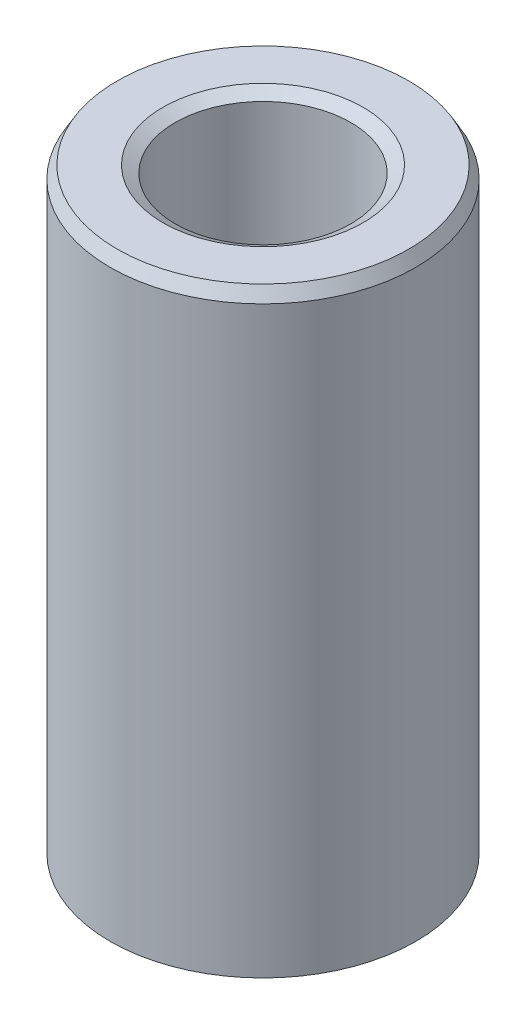
ISO-10303-21;
HEADER;
FILE_DESCRIPTION(('STEP AP214'),'2;1');
FILE_NAME('part.step','',(''),(''),'','','');
FILE_SCHEMA(('AUTOMOTIVE_DESIGN { 1 0 10303 214 1 1 1 1 }'));
ENDSEC;
DATA;
#1=APPLICATION_CONTEXT('core data for automotive mechanical design processes');
#2=APPLICATION_PROTOCOL_DEFINITION('international standard','automotive_design',2000,#1);
#3=PRODUCT_CONTEXT('',#1,'mechanical');
#4=PRODUCT('Part','Part','',(#3));
#5=PRODUCT_RELATED_PRODUCT_CATEGORY('part','',(#4));
#6=PRODUCT_DEFINITION_FORMATION('','',#4);
#7=PRODUCT_DEFINITION_CONTEXT('part definition',#1,'design');
#8=PRODUCT_DEFINITION('design','',#6,#7);
#9=PRODUCT_DEFINITION_SHAPE('','',#8);
#10=(LENGTH_UNIT() NAMED_UNIT(*) SI_UNIT(.MILLI.,.METRE.));
#11=(NAMED_UNIT(*) PLANE_ANGLE_UNIT() SI_UNIT($,.RADIAN.));
#12=(NAMED_UNIT(*) SI_UNIT($,.STERADIAN.) SOLID_ANGLE_UNIT());
#13=UNCERTAINTY_MEASURE_WITH_UNIT(LENGTH_MEASURE(1.E-05),#10,'distance_accuracy_value','');
#14=(GEOMETRIC_REPRESENTATION_CONTEXT(3) GLOBAL_UNCERTAINTY_ASSIGNED_CONTEXT((#13)) GLOBAL_UNIT_ASSIGNED_CONTEXT((#10,
#11,#12)) REPRESENTATION_CONTEXT('',''));
#15=CARTESIAN_POINT('',(0.,0.,0.));
#16=DIRECTION('',(0.,0.,1.));
#17=DIRECTION('',(1.,0.,0.));
#18=AXIS2_PLACEMENT_3D('',#15,#16,#17);
#19=CARTESIAN_POINT('',(0.,138.092901056444,0.));
#20=DIRECTION('',(0.,-1.,0.));
#21=DIRECTION('',(0.,0.,-1.));
#22=AXIS2_PLACEMENT_3D('',#19,#20,#21);
#23=CYLINDRICAL_SURFACE('',#22,35.);
#24=CARTESIAN_POINT('',(0.,1.61965639797385,0.));
#25=DIRECTION('',(0.,1.,0.));
#26=DIRECTION('',(0.,0.,1.));
#27=AXIS2_PLACEMENT_3D('',#24,#25,#26);
#28=CIRCLE('',#27,35.);
#29=CARTESIAN_POINT('',(0.,1.61965639797385,35.));
#30=VERTEX_POINT('',#29);
#31=EDGE_CURVE('E10',#30,#30,#28,.T.);
#32=ORIENTED_EDGE('',*,*,#31,.T.);
#33=EDGE_LOOP('',(#32));
#34=FACE_BOUND('',#33,.T.);
#35=CARTESIAN_POINT('',(0.,135.28757388435,0.));
#36=DIRECTION('',(0.,1.,0.));
#37=DIRECTION('',(0.,0.,1.));
#38=AXIS2_PLACEMENT_3D('',#35,#36,#37);
#39=CIRCLE('',#38,35.);
#40=CARTESIAN_POINT('',(0.,135.28757388435,35.));
#41=VERTEX_POINT('',#40);
#42=EDGE_CURVE('E50',#41,#41,#39,.F.);
#43=ORIENTED_EDGE('',*,*,#42,.T.);
#44=EDGE_LOOP('',(#43));
#45=FACE_BOUND('',#44,.T.);
#46=ADVANCED_FACE('F39',(#34,#45),#23,.T.);
#47=CARTESIAN_POINT('',(0.,138.092901056444,0.));
#48=DIRECTION('',(0.,1.,0.));
#49=DIRECTION('',(0.,0.,1.));
#50=AXIS2_PLACEMENT_3D('',#47,#48,#49);
#51=PLANE('',#50);
#52=CARTESIAN_POINT('',(0.,138.092901056444,0.));
#53=DIRECTION('',(0.,1.,0.));
#54=DIRECTION('',(0.,0.,1.));
#55=AXIS2_PLACEMENT_3D('',#52,#53,#54);
#56=CIRCLE('',#55,22.9193734894898);
#57=CARTESIAN_POINT('',(0.,138.092901056444,22.9193734894898));
#58=VERTEX_POINT('',#57);
#59=EDGE_CURVE('E58',#58,#58,#56,.F.);
#60=ORIENTED_EDGE('',*,*,#59,.T.);
#61=EDGE_LOOP('',(#60));
#62=FACE_BOUND('',#61,.T.);
#63=CARTESIAN_POINT('',(0.,138.092901056444,0.));
#64=DIRECTION('',(0.,1.,0.));
#65=DIRECTION('',(0.,0.,1.));
#66=AXIS2_PLACEMENT_3D('',#63,#64,#65);
#67=CIRCLE('',#66,33.3803436020262);
#68=CARTESIAN_POINT('',(0.,138.092901056444,33.3803436020262));
#69=VERTEX_POINT('',#68);
#70=EDGE_CURVE('E61',#69,#69,#67,.T.);
#71=ORIENTED_EDGE('',*,*,#70,.T.);
#72=EDGE_LOOP('',(#71));
#73=FACE_BOUND('',#72,.T.);
#74=ADVANCED_FACE('F88',(#62,#73),#51,.T.);
#75=CARTESIAN_POINT('',(0.,0.,0.));
#76=DIRECTION('',(0.,1.,0.));
#77=DIRECTION('',(0.,0.,1.));
#78=AXIS2_PLACEMENT_3D('',#75,#76,#77);
#79=PLANE('',#78);
#80=CARTESIAN_POINT('',(0.,0.,0.));
#81=DIRECTION('',(0.,1.,0.));
#82=DIRECTION('',(0.,0.,1.));
#83=AXIS2_PLACEMENT_3D('',#80,#81,#82);
#84=CIRCLE('',#83,21.733702715369);
#85=CARTESIAN_POINT('',(0.,0.,21.733702715369));
#86=VERTEX_POINT('',#85);
#87=EDGE_CURVE('E51',#86,#86,#84,.T.);
#88=ORIENTED_EDGE('',*,*,#87,.T.);
#89=EDGE_LOOP('',(#88));
#90=FACE_BOUND('',#89,.T.);
#91=CARTESIAN_POINT('',(0.,0.,0.));
#92=DIRECTION('',(0.,1.,0.));
#93=DIRECTION('',(0.,0.,1.));
#94=AXIS2_PLACEMENT_3D('',#91,#92,#93);
#95=CIRCLE('',#94,32.1946728279053);
#96=CARTESIAN_POINT('',(0.,0.,32.1946728279053));
#97=VERTEX_POINT('',#96);
#98=EDGE_CURVE('E54',#97,#97,#95,.F.);
#99=ORIENTED_EDGE('',*,*,#98,.T.);
#100=EDGE_LOOP('',(#99));
#101=FACE_BOUND('',#100,.T.);
#102=ADVANCED_FACE('F83',(#90,#101),#79,.F.);
#103=CARTESIAN_POINT('',(0.,138.092901056444,0.));
#104=DIRECTION('',(0.,-1.,0.));
#105=DIRECTION('',(0.,0.,-1.));
#106=AXIS2_PLACEMENT_3D('',#103,#104,#105);
#107=CYLINDRICAL_SURFACE('',#106,20.1140463173952);
#108=CARTESIAN_POINT('',(0.,136.47324465847,0.));
#109=DIRECTION('',(0.,1.,0.));
#110=DIRECTION('',(0.,0.,1.));
#111=AXIS2_PLACEMENT_3D('',#108,#109,#110);
#112=CIRCLE('',#111,20.1140463173952);
#113=CARTESIAN_POINT('',(0.,136.47324465847,20.1140463173952));
#114=VERTEX_POINT('',#113);
#115=EDGE_CURVE('E67',#114,#114,#112,.T.);
#116=ORIENTED_EDGE('',*,*,#115,.T.);
#117=EDGE_LOOP('',(#116));
#118=FACE_BOUND('',#117,.T.);
#119=CARTESIAN_POINT('',(0.,2.80532717209472,0.));
#120=DIRECTION('',(0.,1.,0.));
#121=DIRECTION('',(0.,0.,1.));
#122=AXIS2_PLACEMENT_3D('',#119,#120,#121);
#123=CIRCLE('',#122,20.1140463173952);
#124=CARTESIAN_POINT('',(0.,2.80532717209472,20.1140463173952));
#125=VERTEX_POINT('',#124);
#126=EDGE_CURVE('E69',#125,#125,#123,.F.);
#127=ORIENTED_EDGE('',*,*,#126,.T.);
#128=EDGE_LOOP('',(#127));
#129=FACE_BOUND('',#128,.T.);
#130=ADVANCED_FACE('F71',(#118,#129),#107,.F.);
#131=CARTESIAN_POINT('',(0.,136.47324465847,0.));
#132=DIRECTION('',(0.,1.,0.));
#133=DIRECTION('',(0.,0.,1.));
#134=AXIS2_PLACEMENT_3D('',#131,#132,#133);
#135=CONICAL_SURFACE('',#134,20.1140463173952,1.0471975511966);
#136=CARTESIAN_POINT('',(0.,138.092901056444,22.9193734894898));
#137=CARTESIAN_POINT('',(0.,138.076029635632,22.8901513314472));
#138=CARTESIAN_POINT('',(0.,138.05915821482,22.8609291734045));
#139=CARTESIAN_POINT('',(0.,138.025415373195,22.8024848573192));
#140=CARTESIAN_POINT('',(0.,138.008543952383,22.7732626992765));
#141=CARTESIAN_POINT('',(0.,137.974801110759,22.7148183831912));
#142=CARTESIAN_POINT('',(0.,137.957929689946,22.6855962251486));
#143=CARTESIAN_POINT('',(0.,137.924186848322,22.6271519090633));
#144=CARTESIAN_POINT('',(0.,137.90731542751,22.5979297510206));
#145=CARTESIAN_POINT('',(0.,137.873572585885,22.5394854349353));
#146=CARTESIAN_POINT('',(0.,137.856701165073,22.5102632768927));
#147=CARTESIAN_POINT('',(0.,137.822958323449,22.4518189608074));
#148=CARTESIAN_POINT('',(0.,137.806086902636,22.4225968027647));
#149=CARTESIAN_POINT('',(0.,137.772344061012,22.3641524866794));
#150=CARTESIAN_POINT('',(0.,137.7554726402,22.3349303286368));
#151=CARTESIAN_POINT('',(0.,137.721729798575,22.2764860125515));
#152=CARTESIAN_POINT('',(0.,137.704858377763,22.2472638545088));
#153=CARTESIAN_POINT('',(0.,137.671115536139,22.1888195384235));
#154=CARTESIAN_POINT('',(0.,137.654244115326,22.1595973803808));
#155=CARTESIAN_POINT('',(0.,137.620501273702,22.1011530642955));
#156=CARTESIAN_POINT('',(0.,137.60362985289,22.0719309062529));
#157=CARTESIAN_POINT('',(0.,137.569887011265,22.0134865901676));
#158=CARTESIAN_POINT('',(0.,137.553015590453,21.9842644321249));
#159=CARTESIAN_POINT('',(0.,137.519272748828,21.9258201160396));
#160=CARTESIAN_POINT('',(0.,137.502401328016,21.896597957997));
#161=CARTESIAN_POINT('',(0.,137.468658486392,21.8381536419117));
#162=CARTESIAN_POINT('',(0.,137.45178706558,21.808931483869));
#163=CARTESIAN_POINT('',(0.,137.418044223955,21.7504871677837));
#164=CARTESIAN_POINT('',(0.,137.401172803143,21.721265009741));
#165=CARTESIAN_POINT('',(0.,137.367429961518,21.6628206936557));
#166=CARTESIAN_POINT('',(0.,137.350558540706,21.6335985356131));
#167=CARTESIAN_POINT('',(0.,137.316815699082,21.5751542195278));
#168=CARTESIAN_POINT('',(0.,137.299944278269,21.5459320614851));
#169=CARTESIAN_POINT('',(0.,137.266201436645,21.4874877453998));
#170=CARTESIAN_POINT('',(0.,137.249330015833,21.4582655873572));
#171=CARTESIAN_POINT('',(0.,137.215587174208,21.3998212712719));
#172=CARTESIAN_POINT('',(0.,137.198715753396,21.3705991132292));
#173=CARTESIAN_POINT('',(0.,137.164972911772,21.3121547971439));
#174=CARTESIAN_POINT('',(0.,137.148101490959,21.2829326391013));
#175=CARTESIAN_POINT('',(0.,137.114358649335,21.224488323016));
#176=CARTESIAN_POINT('',(0.,137.097487228523,21.1952661649733));
#177=CARTESIAN_POINT('',(0.,137.063744386898,21.136821848888));
#178=CARTESIAN_POINT('',(0.,137.046872966086,21.1075996908453));
#179=CARTESIAN_POINT('',(0.,137.013130124462,21.04915537476));
#180=CARTESIAN_POINT('',(0.,136.996258703649,21.0199332167174));
#181=CARTESIAN_POINT('',(0.,136.962515862025,20.9614889006321));
#182=CARTESIAN_POINT('',(0.,136.945644441213,20.9322667425894));
#183=CARTESIAN_POINT('',(0.,136.911901599588,20.8738224265041));
#184=CARTESIAN_POINT('',(0.,136.895030178776,20.8446002684615));
#185=CARTESIAN_POINT('',(0.,136.861287337152,20.7861559523762));
#186=CARTESIAN_POINT('',(0.,136.844415916339,20.7569337943335));
#187=CARTESIAN_POINT('',(0.,136.810673074715,20.6984894782482));
#188=CARTESIAN_POINT('',(0.,136.793801653903,20.6692673202056));
#189=CARTESIAN_POINT('',(0.,136.760058812278,20.6108230041203));
#190=CARTESIAN_POINT('',(0.,136.743187391466,20.5816008460776));
#191=CARTESIAN_POINT('',(0.,136.709444549842,20.5231565299923));
#192=CARTESIAN_POINT('',(0.,136.692573129029,20.4939343719496));
#193=CARTESIAN_POINT('',(0.,136.658830287405,20.4354900558643));
#194=CARTESIAN_POINT('',(0.,136.641958866593,20.4062678978217));
#195=CARTESIAN_POINT('',(0.,136.608216024968,20.3478235817364));
#196=CARTESIAN_POINT('',(0.,136.591344604156,20.3186014236937));
#197=CARTESIAN_POINT('',(0.,136.557601762532,20.2601571076084));
#198=CARTESIAN_POINT('',(0.,136.540730341719,20.2309349495658));
#199=CARTESIAN_POINT('',(0.,136.506987500095,20.1724906334805));
#200=CARTESIAN_POINT('',(0.,136.490116079283,20.1432684754378));
#201=CARTESIAN_POINT('',(0.,136.47324465847,20.1140463173952));
#202=B_SPLINE_CURVE_WITH_KNOTS('',3,(#136,#137,#138,#139,#140,#141,#142,#143,#144,#145,#146,
#147,#148,#149,#150,#151,#152,#153,#154,#155,#156,#157,#158,#159,#160,#161,#162,#163,#164,#165,
#166,#167,#168,#169,#170,#171,#172,#173,#174,#175,#176,#177,#178,#179,#180,#181,#182,#183,#184,
#185,#186,#187,#188,#189,#190,#191,#192,#193,#194,#195,#196,#197,#198,#199,#200,#201),
.UNSPECIFIED.,.F.,.F.,(4,2,2,2,2,2,2,2,2,2,2,2,2,2,2,2,2,2,2,2,2,2,2,2,2,2,2,2,2,2,2,2,4),(0.,
0.101228524873365,0.202457049746733,0.303685574620098,0.404914099493466,0.506142624366816,
0.607371149240184,0.708599674113552,0.809828198986917,0.911056723860285,1.01228524873364,
1.113513773607,1.21474229848037,1.31597082335374,1.41719934822709,1.51842787310046,
1.61965639797382,1.72088492284719,1.82211344772056,1.92334197259391,2.02457049746728,
2.12579902234064,2.22702754721401,2.32825607208736,2.42948459696073,2.5307131218341,
2.63194164670746,2.73317017158083,2.83439869645418,2.93562722132755,3.03685574620091,
3.13808427107428,3.23931279594763),.UNSPECIFIED.);
#203=EDGE_CURVE('BSEAM77',#58,#114,#202,.T.);
#204=ORIENTED_EDGE('',*,*,#59,.F.);
#205=ORIENTED_EDGE('',*,*,#115,.F.);
#206=ORIENTED_EDGE('',*,*,#203,.T.);
#207=ORIENTED_EDGE('',*,*,#203,.F.);
#208=EDGE_LOOP('',(#204,#206,#205,#207));
#209=FACE_BOUND('',#208,.T.);
#210=ADVANCED_FACE('F77',(#209),#135,.F.);
#211=CARTESIAN_POINT('',(0.,0.,0.));
#212=DIRECTION('',(0.,-1.,0.));
#213=DIRECTION('',(0.,0.,-1.));
#214=AXIS2_PLACEMENT_3D('',#211,#212,#213);
#215=CONICAL_SURFACE('',#214,21.733702715369,0.523598775598297);
#216=ORIENTED_EDGE('',*,*,#126,.F.);
#217=EDGE_LOOP('',(#216));
#218=FACE_BOUND('',#217,.T.);
#219=ORIENTED_EDGE('',*,*,#87,.F.);
#220=EDGE_LOOP('',(#219));
#221=FACE_BOUND('',#220,.T.);
#222=ADVANCED_FACE('F73',(#218,#221),#215,.F.);
#223=CARTESIAN_POINT('',(0.,1.61965639797385,0.));
#224=DIRECTION('',(0.,1.,0.));
#225=DIRECTION('',(0.,0.,1.));
#226=AXIS2_PLACEMENT_3D('',#223,#224,#225);
#227=CONICAL_SURFACE('',#226,35.,1.0471975511966);
#228=CARTESIAN_POINT('',(0.,0.,32.1946728279053));
#229=CARTESIAN_POINT('',(0.,0.0168714208122273,32.2238949859479));
#230=CARTESIAN_POINT('',(0.,0.0337428416244549,32.2531171439906));
#231=CARTESIAN_POINT('',(0.,0.06748568324891,32.3115614600759));
#232=CARTESIAN_POINT('',(0.,0.0843571040611376,32.3407836181186));
#233=CARTESIAN_POINT('',(0.,0.118099945685593,32.3992279342039));
#234=CARTESIAN_POINT('',(0.,0.13497136649782,32.4284500922465));
#235=CARTESIAN_POINT('',(0.,0.168714208122275,32.4868944083318));
#236=CARTESIAN_POINT('',(0.,0.185585628934503,32.5161165663745));
#237=CARTESIAN_POINT('',(0.,0.219328470558958,32.5745608824598));
#238=CARTESIAN_POINT('',(0.,0.236199891371185,32.6037830405024));
#239=CARTESIAN_POINT('',(0.,0.269942732995641,32.6622273565877));
#240=CARTESIAN_POINT('',(0.,0.286814153807869,32.6914495146304));
#241=CARTESIAN_POINT('',(0.,0.320556995432324,32.7498938307157));
#242=CARTESIAN_POINT('',(0.,0.337428416244551,32.7791159887584));
#243=CARTESIAN_POINT('',(0.,0.371171257869005,32.8375603048437));
#244=CARTESIAN_POINT('',(0.,0.388042678681233,32.8667824628863));
#245=CARTESIAN_POINT('',(0.,0.421785520305689,32.9252267789716));
#246=CARTESIAN_POINT('',(0.,0.438656941117916,32.9544489370143));
#247=CARTESIAN_POINT('',(0.,0.472399782742371,33.0128932530996));
#248=CARTESIAN_POINT('',(0.,0.489271203554599,33.0421154111422));
#249=CARTESIAN_POINT('',(0.,0.523014045179054,33.1005597272275));
#250=CARTESIAN_POINT('',(0.,0.539885465991282,33.1297818852702));
#251=CARTESIAN_POINT('',(0.,0.573628307615737,33.1882262013555));
#252=CARTESIAN_POINT('',(0.,0.590499728427964,33.2174483593982));
#253=CARTESIAN_POINT('',(0.,0.624242570052419,33.2758926754835));
#254=CARTESIAN_POINT('',(0.,0.641113990864647,33.3051148335261));
#255=CARTESIAN_POINT('',(0.,0.674856832489102,33.3635591496114));
#256=CARTESIAN_POINT('',(0.,0.69172825330133,33.3927813076541));
#257=CARTESIAN_POINT('',(0.,0.725471094925785,33.4512256237394));
#258=CARTESIAN_POINT('',(0.,0.742342515738012,33.480447781782));
#259=CARTESIAN_POINT('',(0.,0.776085357362468,33.5388920978673));
#260=CARTESIAN_POINT('',(0.,0.792956778174696,33.56811425591));
#261=CARTESIAN_POINT('',(0.,0.82669961979915,33.6265585719953));
#262=CARTESIAN_POINT('',(0.,0.843571040611377,33.655780730038));
#263=CARTESIAN_POINT('',(0.,0.877313882235832,33.7142250461233));
#264=CARTESIAN_POINT('',(0.,0.89418530304806,33.7434472041659));
#265=CARTESIAN_POINT('',(0.,0.927928144672516,33.8018915202512));
#266=CARTESIAN_POINT('',(0.,0.944799565484743,33.8311136782939));
#267=CARTESIAN_POINT('',(0.,0.978542407109198,33.8895579943792));
#268=CARTESIAN_POINT('',(0.,0.995413827921426,33.9187801524218));
#269=CARTESIAN_POINT('',(0.,1.02915666954588,33.9772244685071));
#270=CARTESIAN_POINT('',(0.,1.04602809035811,34.0064466265498));
#271=CARTESIAN_POINT('',(0.,1.07977093198256,34.0648909426351));
#272=CARTESIAN_POINT('',(0.,1.09664235279479,34.0941131006778));
#273=CARTESIAN_POINT('',(0.,1.13038519441925,34.1525574167631));
#274=CARTESIAN_POINT('',(0.,1.14725661523147,34.1817795748057));
#275=CARTESIAN_POINT('',(0.,1.18099945685593,34.240223890891));
#276=CARTESIAN_POINT('',(0.,1.19787087766816,34.2694460489337));
#277=CARTESIAN_POINT('',(0.,1.23161371929261,34.327890365019));
#278=CARTESIAN_POINT('',(0.,1.24848514010484,34.3571125230616));
#279=CARTESIAN_POINT('',(0.,1.28222798172929,34.4155568391469));
#280=CARTESIAN_POINT('',(0.,1.29909940254152,34.4447789971896));
#281=CARTESIAN_POINT('',(0.,1.33284224416598,34.5032233132749));
#282=CARTESIAN_POINT('',(0.,1.3497136649782,34.5324454713176));
#283=CARTESIAN_POINT('',(0.,1.38345650660266,34.5908897874029));
#284=CARTESIAN_POINT('',(0.,1.40032792741489,34.6201119454455));
#285=CARTESIAN_POINT('',(0.,1.43407076903934,34.6785562615308));
#286=CARTESIAN_POINT('',(0.,1.45094218985157,34.7077784195735));
#287=CARTESIAN_POINT('',(0.,1.48468503147602,34.7662227356588));
#288=CARTESIAN_POINT('',(0.,1.50155645228825,34.7954448937014));
#289=CARTESIAN_POINT('',(0.,1.53529929391271,34.8538892097867));
#290=CARTESIAN_POINT('',(0.,1.55217071472493,34.8831113678294));
#291=CARTESIAN_POINT('',(0.,1.58591355634939,34.9415556839147));
#292=CARTESIAN_POINT('',(0.,1.60278497716162,34.9707778419574));
#293=CARTESIAN_POINT('',(0.,1.61965639797385,35.));
#294=B_SPLINE_CURVE_WITH_KNOTS('',3,(#228,#229,#230,#231,#232,#233,#234,#235,#236,#237,#238,
#239,#240,#241,#242,#243,#244,#245,#246,#247,#248,#249,#250,#251,#252,#253,#254,#255,#256,#257,
#258,#259,#260,#261,#262,#263,#264,#265,#266,#267,#268,#269,#270,#271,#272,#273,#274,#275,#276,
#277,#278,#279,#280,#281,#282,#283,#284,#285,#286,#287,#288,#289,#290,#291,#292,#293),
.UNSPECIFIED.,.F.,.F.,(4,2,2,2,2,2,2,2,2,2,2,2,2,2,2,2,2,2,2,2,2,2,2,2,2,2,2,2,2,2,2,2,4),(0.,
0.101228524873365,0.202457049746731,0.303685574620096,0.404914099493461,0.506142624366826,
0.607371149240192,0.708599674113563,0.809828198986928,0.911056723860294,1.01228524873366,
1.11351377360702,1.21474229848039,1.31597082335376,1.41719934822712,1.51842787310049,
1.61965639797385,1.72088492284722,1.82211344772059,1.92334197259395,2.02457049746732,
2.12579902234068,2.22702754721405,2.32825607208741,2.42948459696078,2.53071312183414,
2.63194164670751,2.73317017158088,2.83439869645425,2.93562722132761,3.03685574620098,
3.13808427107434,3.23931279594771),.UNSPECIFIED.);
#295=EDGE_CURVE('BSEAM76',#97,#30,#294,.T.);
#296=ORIENTED_EDGE('',*,*,#98,.F.);
#297=ORIENTED_EDGE('',*,*,#31,.F.);
#298=ORIENTED_EDGE('',*,*,#295,.T.);
#299=ORIENTED_EDGE('',*,*,#295,.F.);
#300=EDGE_LOOP('',(#296,#298,#297,#299));
#301=FACE_BOUND('',#300,.T.);
#302=ADVANCED_FACE('F76',(#301),#227,.T.);
#303=CARTESIAN_POINT('',(0.,138.092901056444,0.));
#304=DIRECTION('',(0.,-1.,0.));
#305=DIRECTION('',(0.,0.,-1.));
#306=AXIS2_PLACEMENT_3D('',#303,#304,#305);
#307=CONICAL_SURFACE('',#306,33.3803436020262,0.523598775598294);
#308=ORIENTED_EDGE('',*,*,#42,.F.);
#309=EDGE_LOOP('',(#308));
#310=FACE_BOUND('',#309,.T.);
#311=ORIENTED_EDGE('',*,*,#70,.F.);
#312=EDGE_LOOP('',(#311));
#313=FACE_BOUND('',#312,.T.);
#314=ADVANCED_FACE('F45',(#310,#313),#307,.T.);
#315=CLOSED_SHELL('',(#46,#74,#102,#130,#210,#222,#302,#314));
#316=MANIFOLD_SOLID_BREP('B2',#315);
#317=ADVANCED_BREP_SHAPE_REPRESENTATION('',(#18,#316),#14);
#318=SHAPE_DEFINITION_REPRESENTATION(#9,#317);
ENDSEC;
END-ISO-10303-21;
